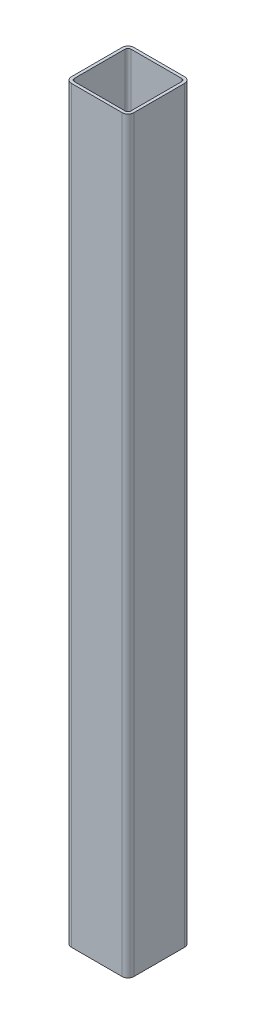
ISO-10303-21;
HEADER;
FILE_DESCRIPTION(('STEP AP214'),'2;1');
FILE_NAME('part.step','',(''),(''),'','','');
FILE_SCHEMA(('AUTOMOTIVE_DESIGN { 1 0 10303 214 1 1 1 1 }'));
ENDSEC;
DATA;
#1=APPLICATION_CONTEXT('core data for automotive mechanical design processes');
#2=APPLICATION_PROTOCOL_DEFINITION('international standard','automotive_design',2000,#1);
#3=PRODUCT_CONTEXT('',#1,'mechanical');
#4=PRODUCT('Part','Part','',(#3));
#5=PRODUCT_RELATED_PRODUCT_CATEGORY('part','',(#4));
#6=PRODUCT_DEFINITION_FORMATION('','',#4);
#7=PRODUCT_DEFINITION_CONTEXT('part definition',#1,'design');
#8=PRODUCT_DEFINITION('design','',#6,#7);
#9=PRODUCT_DEFINITION_SHAPE('','',#8);
#10=(LENGTH_UNIT() NAMED_UNIT(*) SI_UNIT(.MILLI.,.METRE.));
#11=(NAMED_UNIT(*) PLANE_ANGLE_UNIT() SI_UNIT($,.RADIAN.));
#12=(NAMED_UNIT(*) SI_UNIT($,.STERADIAN.) SOLID_ANGLE_UNIT());
#13=UNCERTAINTY_MEASURE_WITH_UNIT(LENGTH_MEASURE(1.E-05),#10,'distance_accuracy_value','');
#14=(GEOMETRIC_REPRESENTATION_CONTEXT(3) GLOBAL_UNCERTAINTY_ASSIGNED_CONTEXT((#13)) GLOBAL_UNIT_ASSIGNED_CONTEXT((#10,
#11,#12)) REPRESENTATION_CONTEXT('',''));
#15=CARTESIAN_POINT('',(0.,0.,0.));
#16=DIRECTION('',(0.,0.,1.));
#17=DIRECTION('',(1.,0.,0.));
#18=AXIS2_PLACEMENT_3D('',#15,#16,#17);
#19=CARTESIAN_POINT('',(41.275,609.6,-41.275));
#20=DIRECTION('',(0.,1.,0.));
#21=DIRECTION('',(0.,0.,1.));
#22=AXIS2_PLACEMENT_3D('',#19,#20,#21);
#23=PLANE('',#22);
#24=CARTESIAN_POINT('',(41.275,609.6,-41.275));
#25=DIRECTION('',(0.,1.,0.));
#26=DIRECTION('',(0.,0.,1.));
#27=AXIS2_PLACEMENT_3D('',#24,#25,#26);
#28=CIRCLE('',#27,9.525);
#29=CARTESIAN_POINT('',(50.8,609.6,-41.275));
#30=VERTEX_POINT('',#29);
#31=CARTESIAN_POINT('',(41.275,609.6,-50.8));
#32=VERTEX_POINT('',#31);
#33=EDGE_CURVE('E220',#30,#32,#28,.T.);
#34=ORIENTED_EDGE('',*,*,#33,.T.);
#35=DIRECTION('',(-1.,0.,0.));
#36=VECTOR('',#35,1.);
#37=CARTESIAN_POINT('',(41.275,609.6,-50.8));
#38=LINE('',#37,#36);
#39=CARTESIAN_POINT('',(-41.275,609.6,-50.7999999999999));
#40=VERTEX_POINT('',#39);
#41=EDGE_CURVE('E223',#32,#40,#38,.T.);
#42=ORIENTED_EDGE('',*,*,#41,.T.);
#43=CARTESIAN_POINT('',(-41.275,609.6,-41.2749999999999));
#44=DIRECTION('',(0.,1.,0.));
#45=DIRECTION('',(0.,0.,1.));
#46=AXIS2_PLACEMENT_3D('',#43,#44,#45);
#47=CIRCLE('',#46,9.52500000000001);
#48=CARTESIAN_POINT('',(-50.8,609.6,-41.2749999999999));
#49=VERTEX_POINT('',#48);
#50=EDGE_CURVE('E226',#40,#49,#47,.T.);
#51=ORIENTED_EDGE('',*,*,#50,.T.);
#52=DIRECTION('',(0.,0.,1.));
#53=VECTOR('',#52,1.);
#54=CARTESIAN_POINT('',(-50.8,609.6,41.275));
#55=LINE('',#54,#53);
#56=CARTESIAN_POINT('',(-50.8,609.6,41.275));
#57=VERTEX_POINT('',#56);
#58=EDGE_CURVE('E228',#49,#57,#55,.T.);
#59=ORIENTED_EDGE('',*,*,#58,.T.);
#60=CARTESIAN_POINT('',(-41.275,609.6,41.275));
#61=DIRECTION('',(0.,1.,0.));
#62=DIRECTION('',(0.,0.,1.));
#63=AXIS2_PLACEMENT_3D('',#60,#61,#62);
#64=CIRCLE('',#63,9.52499999999999);
#65=CARTESIAN_POINT('',(-41.275,609.6,50.8));
#66=VERTEX_POINT('',#65);
#67=EDGE_CURVE('E230',#57,#66,#64,.T.);
#68=ORIENTED_EDGE('',*,*,#67,.T.);
#69=DIRECTION('',(1.,0.,0.));
#70=VECTOR('',#69,1.);
#71=CARTESIAN_POINT('',(-41.275,609.6,50.8));
#72=LINE('',#71,#70);
#73=CARTESIAN_POINT('',(41.275,609.6,50.8));
#74=VERTEX_POINT('',#73);
#75=EDGE_CURVE('E232',#66,#74,#72,.T.);
#76=ORIENTED_EDGE('',*,*,#75,.T.);
#77=CARTESIAN_POINT('',(41.275,609.6,41.275));
#78=DIRECTION('',(0.,1.,0.));
#79=DIRECTION('',(0.,0.,1.));
#80=AXIS2_PLACEMENT_3D('',#77,#78,#79);
#81=CIRCLE('',#80,9.52500000000001);
#82=CARTESIAN_POINT('',(50.8,609.6,41.275));
#83=VERTEX_POINT('',#82);
#84=EDGE_CURVE('E234',#74,#83,#81,.T.);
#85=ORIENTED_EDGE('',*,*,#84,.T.);
#86=DIRECTION('',(0.,0.,-1.));
#87=VECTOR('',#86,1.);
#88=CARTESIAN_POINT('',(50.8,609.6,-41.275));
#89=LINE('',#88,#87);
#90=EDGE_CURVE('E236',#83,#30,#89,.T.);
#91=ORIENTED_EDGE('',*,*,#90,.T.);
#92=EDGE_LOOP('',(#34,#42,#51,#59,#68,#76,#85,#91));
#93=FACE_BOUND('',#92,.T.);
#94=DIRECTION('',(0.,0.,1.));
#95=VECTOR('',#94,1.);
#96=CARTESIAN_POINT('',(-46.0375,609.6,41.275));
#97=LINE('',#96,#95);
#98=CARTESIAN_POINT('',(-46.0375,609.6,-41.275));
#99=VERTEX_POINT('',#98);
#100=CARTESIAN_POINT('',(-46.0375,609.6,41.275));
#101=VERTEX_POINT('',#100);
#102=EDGE_CURVE('E157',#99,#101,#97,.T.);
#103=ORIENTED_EDGE('',*,*,#102,.F.);
#104=CARTESIAN_POINT('',(-41.275,609.6,-41.275));
#105=DIRECTION('',(0.,1.,0.));
#106=DIRECTION('',(0.,0.,1.));
#107=AXIS2_PLACEMENT_3D('',#104,#105,#106);
#108=CIRCLE('',#107,4.76249999999998);
#109=CARTESIAN_POINT('',(-41.275,609.6,-46.0375));
#110=VERTEX_POINT('',#109);
#111=EDGE_CURVE('E149',#110,#99,#108,.T.);
#112=ORIENTED_EDGE('',*,*,#111,.F.);
#113=DIRECTION('',(-1.,0.,0.));
#114=VECTOR('',#113,1.);
#115=CARTESIAN_POINT('',(41.275,609.6,-46.0375));
#116=LINE('',#115,#114);
#117=CARTESIAN_POINT('',(41.275,609.6,-46.0375));
#118=VERTEX_POINT('',#117);
#119=EDGE_CURVE('E183',#118,#110,#116,.T.);
#120=ORIENTED_EDGE('',*,*,#119,.F.);
#121=CARTESIAN_POINT('',(41.275,609.6,-41.275));
#122=DIRECTION('',(0.,1.,0.));
#123=DIRECTION('',(0.,0.,1.));
#124=AXIS2_PLACEMENT_3D('',#121,#122,#123);
#125=CIRCLE('',#124,4.76249999999998);
#126=CARTESIAN_POINT('',(46.0375,609.6,-41.275));
#127=VERTEX_POINT('',#126);
#128=EDGE_CURVE('E181',#127,#118,#125,.T.);
#129=ORIENTED_EDGE('',*,*,#128,.F.);
#130=DIRECTION('',(0.,0.,-1.));
#131=VECTOR('',#130,1.);
#132=CARTESIAN_POINT('',(46.0375,609.6,-41.275));
#133=LINE('',#132,#131);
#134=CARTESIAN_POINT('',(46.0375,609.6,41.275));
#135=VERTEX_POINT('',#134);
#136=EDGE_CURVE('E179',#135,#127,#133,.T.);
#137=ORIENTED_EDGE('',*,*,#136,.F.);
#138=CARTESIAN_POINT('',(41.275,609.6,41.275));
#139=DIRECTION('',(0.,1.,0.));
#140=DIRECTION('',(0.,0.,1.));
#141=AXIS2_PLACEMENT_3D('',#138,#139,#140);
#142=CIRCLE('',#141,4.76249999999998);
#143=CARTESIAN_POINT('',(41.275,609.6,46.0375));
#144=VERTEX_POINT('',#143);
#145=EDGE_CURVE('E177',#144,#135,#142,.T.);
#146=ORIENTED_EDGE('',*,*,#145,.F.);
#147=DIRECTION('',(1.,0.,0.));
#148=VECTOR('',#147,1.);
#149=CARTESIAN_POINT('',(-41.275,609.6,46.0375));
#150=LINE('',#149,#148);
#151=CARTESIAN_POINT('',(-41.275,609.6,46.0375));
#152=VERTEX_POINT('',#151);
#153=EDGE_CURVE('E173',#152,#144,#150,.T.);
#154=ORIENTED_EDGE('',*,*,#153,.F.);
#155=CARTESIAN_POINT('',(-41.275,609.6,41.275));
#156=DIRECTION('',(0.,1.,0.));
#157=DIRECTION('',(0.,0.,1.));
#158=AXIS2_PLACEMENT_3D('',#155,#156,#157);
#159=CIRCLE('',#158,4.76249999999998);
#160=EDGE_CURVE('E171',#101,#152,#159,.T.);
#161=ORIENTED_EDGE('',*,*,#160,.F.);
#162=EDGE_LOOP('',(#103,#112,#120,#129,#137,#146,#154,#161));
#163=FACE_BOUND('',#162,.T.);
#164=ADVANCED_FACE('F35',(#93,#163),#23,.T.);
#165=CARTESIAN_POINT('',(41.275,-609.6,-41.275));
#166=DIRECTION('',(0.,1.,0.));
#167=DIRECTION('',(0.,0.,1.));
#168=AXIS2_PLACEMENT_3D('',#165,#166,#167);
#169=PLANE('',#168);
#170=CARTESIAN_POINT('',(41.275,-609.6,-41.275));
#171=DIRECTION('',(0.,1.,0.));
#172=DIRECTION('',(0.,0.,1.));
#173=AXIS2_PLACEMENT_3D('',#170,#171,#172);
#174=CIRCLE('',#173,9.525);
#175=CARTESIAN_POINT('',(50.8,-609.6,-41.275));
#176=VERTEX_POINT('',#175);
#177=CARTESIAN_POINT('',(41.275,-609.6,-50.8));
#178=VERTEX_POINT('',#177);
#179=EDGE_CURVE('E166',#176,#178,#174,.T.);
#180=ORIENTED_EDGE('',*,*,#179,.F.);
#181=DIRECTION('',(0.,0.,-1.));
#182=VECTOR('',#181,1.);
#183=CARTESIAN_POINT('',(50.8,-609.6,-41.275));
#184=LINE('',#183,#182);
#185=CARTESIAN_POINT('',(50.8,-609.6,41.275));
#186=VERTEX_POINT('',#185);
#187=EDGE_CURVE('E224',#186,#176,#184,.T.);
#188=ORIENTED_EDGE('',*,*,#187,.F.);
#189=CARTESIAN_POINT('',(41.275,-609.6,41.275));
#190=DIRECTION('',(0.,1.,0.));
#191=DIRECTION('',(0.,0.,1.));
#192=AXIS2_PLACEMENT_3D('',#189,#190,#191);
#193=CIRCLE('',#192,9.52500000000001);
#194=CARTESIAN_POINT('',(41.275,-609.6,50.8));
#195=VERTEX_POINT('',#194);
#196=EDGE_CURVE('E252',#195,#186,#193,.T.);
#197=ORIENTED_EDGE('',*,*,#196,.F.);
#198=DIRECTION('',(1.,0.,0.));
#199=VECTOR('',#198,1.);
#200=CARTESIAN_POINT('',(-41.275,-609.6,50.8));
#201=LINE('',#200,#199);
#202=CARTESIAN_POINT('',(-41.275,-609.6,50.8));
#203=VERTEX_POINT('',#202);
#204=EDGE_CURVE('E250',#203,#195,#201,.T.);
#205=ORIENTED_EDGE('',*,*,#204,.F.);
#206=CARTESIAN_POINT('',(-41.275,-609.6,41.275));
#207=DIRECTION('',(0.,1.,0.));
#208=DIRECTION('',(0.,0.,1.));
#209=AXIS2_PLACEMENT_3D('',#206,#207,#208);
#210=CIRCLE('',#209,9.52499999999999);
#211=CARTESIAN_POINT('',(-50.8,-609.6,41.275));
#212=VERTEX_POINT('',#211);
#213=EDGE_CURVE('E248',#212,#203,#210,.T.);
#214=ORIENTED_EDGE('',*,*,#213,.F.);
#215=DIRECTION('',(0.,0.,1.));
#216=VECTOR('',#215,1.);
#217=CARTESIAN_POINT('',(-50.8,-609.6,41.275));
#218=LINE('',#217,#216);
#219=CARTESIAN_POINT('',(-50.8,-609.6,-41.2749999999999));
#220=VERTEX_POINT('',#219);
#221=EDGE_CURVE('E246',#220,#212,#218,.T.);
#222=ORIENTED_EDGE('',*,*,#221,.F.);
#223=CARTESIAN_POINT('',(-41.275,-609.6,-41.2749999999999));
#224=DIRECTION('',(0.,1.,0.));
#225=DIRECTION('',(0.,0.,1.));
#226=AXIS2_PLACEMENT_3D('',#223,#224,#225);
#227=CIRCLE('',#226,9.52500000000001);
#228=CARTESIAN_POINT('',(-41.275,-609.6,-50.7999999999999));
#229=VERTEX_POINT('',#228);
#230=EDGE_CURVE('E244',#229,#220,#227,.T.);
#231=ORIENTED_EDGE('',*,*,#230,.F.);
#232=DIRECTION('',(-1.,0.,0.));
#233=VECTOR('',#232,1.);
#234=CARTESIAN_POINT('',(41.275,-609.6,-50.8));
#235=LINE('',#234,#233);
#236=EDGE_CURVE('E242',#178,#229,#235,.T.);
#237=ORIENTED_EDGE('',*,*,#236,.F.);
#238=EDGE_LOOP('',(#180,#188,#197,#205,#214,#222,#231,#237));
#239=FACE_BOUND('',#238,.T.);
#240=CARTESIAN_POINT('',(-41.275,-609.6,-41.275));
#241=DIRECTION('',(0.,1.,0.));
#242=DIRECTION('',(0.,0.,1.));
#243=AXIS2_PLACEMENT_3D('',#240,#241,#242);
#244=CIRCLE('',#243,4.76249999999998);
#245=CARTESIAN_POINT('',(-41.275,-609.6,-46.0375));
#246=VERTEX_POINT('',#245);
#247=CARTESIAN_POINT('',(-46.0375,-609.6,-41.275));
#248=VERTEX_POINT('',#247);
#249=EDGE_CURVE('E59',#246,#248,#244,.T.);
#250=ORIENTED_EDGE('',*,*,#249,.T.);
#251=DIRECTION('',(0.,0.,1.));
#252=VECTOR('',#251,1.);
#253=CARTESIAN_POINT('',(-46.0375,-609.6,41.275));
#254=LINE('',#253,#252);
#255=CARTESIAN_POINT('',(-46.0375,-609.6,41.275));
#256=VERTEX_POINT('',#255);
#257=EDGE_CURVE('E164',#248,#256,#254,.T.);
#258=ORIENTED_EDGE('',*,*,#257,.T.);
#259=CARTESIAN_POINT('',(-41.275,-609.6,41.275));
#260=DIRECTION('',(0.,1.,0.));
#261=DIRECTION('',(0.,0.,1.));
#262=AXIS2_PLACEMENT_3D('',#259,#260,#261);
#263=CIRCLE('',#262,4.76249999999998);
#264=CARTESIAN_POINT('',(-41.275,-609.6,46.0375));
#265=VERTEX_POINT('',#264);
#266=EDGE_CURVE('E187',#256,#265,#263,.T.);
#267=ORIENTED_EDGE('',*,*,#266,.T.);
#268=DIRECTION('',(1.,0.,0.));
#269=VECTOR('',#268,1.);
#270=CARTESIAN_POINT('',(-41.275,-609.6,46.0375));
#271=LINE('',#270,#269);
#272=CARTESIAN_POINT('',(41.275,-609.6,46.0375));
#273=VERTEX_POINT('',#272);
#274=EDGE_CURVE('E190',#265,#273,#271,.T.);
#275=ORIENTED_EDGE('',*,*,#274,.T.);
#276=CARTESIAN_POINT('',(41.275,-609.6,41.275));
#277=DIRECTION('',(0.,1.,0.));
#278=DIRECTION('',(0.,0.,1.));
#279=AXIS2_PLACEMENT_3D('',#276,#277,#278);
#280=CIRCLE('',#279,4.76249999999998);
#281=CARTESIAN_POINT('',(46.0375,-609.6,41.275));
#282=VERTEX_POINT('',#281);
#283=EDGE_CURVE('E193',#273,#282,#280,.T.);
#284=ORIENTED_EDGE('',*,*,#283,.T.);
#285=DIRECTION('',(0.,0.,-1.));
#286=VECTOR('',#285,1.);
#287=CARTESIAN_POINT('',(46.0375,-609.6,-41.275));
#288=LINE('',#287,#286);
#289=CARTESIAN_POINT('',(46.0375,-609.6,-41.275));
#290=VERTEX_POINT('',#289);
#291=EDGE_CURVE('E196',#282,#290,#288,.T.);
#292=ORIENTED_EDGE('',*,*,#291,.T.);
#293=CARTESIAN_POINT('',(41.275,-609.6,-41.275));
#294=DIRECTION('',(0.,1.,0.));
#295=DIRECTION('',(0.,0.,1.));
#296=AXIS2_PLACEMENT_3D('',#293,#294,#295);
#297=CIRCLE('',#296,4.76249999999998);
#298=CARTESIAN_POINT('',(41.275,-609.6,-46.0375));
#299=VERTEX_POINT('',#298);
#300=EDGE_CURVE('E199',#290,#299,#297,.T.);
#301=ORIENTED_EDGE('',*,*,#300,.T.);
#302=DIRECTION('',(-1.,0.,0.));
#303=VECTOR('',#302,1.);
#304=CARTESIAN_POINT('',(41.275,-609.6,-46.0375));
#305=LINE('',#304,#303);
#306=EDGE_CURVE('E158',#299,#246,#305,.T.);
#307=ORIENTED_EDGE('',*,*,#306,.T.);
#308=EDGE_LOOP('',(#250,#258,#267,#275,#284,#292,#301,#307));
#309=FACE_BOUND('',#308,.T.);
#310=ADVANCED_FACE('F286',(#239,#309),#169,.F.);
#311=CARTESIAN_POINT('',(41.275,609.6,-41.275));
#312=DIRECTION('',(0.,-1.,0.));
#313=DIRECTION('',(0.,0.,-1.));
#314=AXIS2_PLACEMENT_3D('',#311,#312,#313);
#315=CYLINDRICAL_SURFACE('',#314,9.525);
#316=ORIENTED_EDGE('',*,*,#179,.T.);
#317=DIRECTION('',(0.,-1.,0.));
#318=VECTOR('',#317,1.);
#319=CARTESIAN_POINT('',(41.275,609.6,-50.8));
#320=LINE('',#319,#318);
#321=EDGE_CURVE('E11',#32,#178,#320,.T.);
#322=ORIENTED_EDGE('',*,*,#321,.F.);
#323=ORIENTED_EDGE('',*,*,#33,.F.);
#324=DIRECTION('',(0.,-1.,0.));
#325=VECTOR('',#324,1.);
#326=CARTESIAN_POINT('',(50.8,609.6,-41.275));
#327=LINE('',#326,#325);
#328=EDGE_CURVE('E239',#30,#176,#327,.T.);
#329=ORIENTED_EDGE('',*,*,#328,.T.);
#330=EDGE_LOOP('',(#316,#322,#323,#329));
#331=FACE_BOUND('',#330,.T.);
#332=ADVANCED_FACE('F37',(#331),#315,.T.);
#333=CARTESIAN_POINT('',(41.275,609.6,-50.8));
#334=DIRECTION('',(0.,0.,1.));
#335=DIRECTION('',(1.,0.,0.));
#336=AXIS2_PLACEMENT_3D('',#333,#334,#335);
#337=PLANE('',#336);
#338=ORIENTED_EDGE('',*,*,#236,.T.);
#339=DIRECTION('',(0.,-1.,0.));
#340=VECTOR('',#339,1.);
#341=CARTESIAN_POINT('',(-41.275,609.6,-50.7999999999999));
#342=LINE('',#341,#340);
#343=EDGE_CURVE('E44',#40,#229,#342,.T.);
#344=ORIENTED_EDGE('',*,*,#343,.F.);
#345=ORIENTED_EDGE('',*,*,#41,.F.);
#346=ORIENTED_EDGE('',*,*,#321,.T.);
#347=EDGE_LOOP('',(#338,#344,#345,#346));
#348=FACE_BOUND('',#347,.T.);
#349=ADVANCED_FACE('F303',(#348),#337,.F.);
#350=CARTESIAN_POINT('',(-41.275,609.6,-41.2749999999999));
#351=DIRECTION('',(0.,-1.,0.));
#352=DIRECTION('',(0.,0.,-1.));
#353=AXIS2_PLACEMENT_3D('',#350,#351,#352);
#354=CYLINDRICAL_SURFACE('',#353,9.52500000000001);
#355=ORIENTED_EDGE('',*,*,#230,.T.);
#356=DIRECTION('',(0.,-1.,0.));
#357=VECTOR('',#356,1.);
#358=CARTESIAN_POINT('',(-50.8,609.6,-41.2749999999999));
#359=LINE('',#358,#357);
#360=EDGE_CURVE('E272',#49,#220,#359,.T.);
#361=ORIENTED_EDGE('',*,*,#360,.F.);
#362=ORIENTED_EDGE('',*,*,#50,.F.);
#363=ORIENTED_EDGE('',*,*,#343,.T.);
#364=EDGE_LOOP('',(#355,#361,#362,#363));
#365=FACE_BOUND('',#364,.T.);
#366=ADVANCED_FACE('F280',(#365),#354,.T.);
#367=CARTESIAN_POINT('',(-50.8,609.6,41.275));
#368=DIRECTION('',(1.,0.,0.));
#369=DIRECTION('',(0.,0.,-1.));
#370=AXIS2_PLACEMENT_3D('',#367,#368,#369);
#371=PLANE('',#370);
#372=ORIENTED_EDGE('',*,*,#221,.T.);
#373=DIRECTION('',(0.,-1.,0.));
#374=VECTOR('',#373,1.);
#375=CARTESIAN_POINT('',(-50.8,609.6,41.275));
#376=LINE('',#375,#374);
#377=EDGE_CURVE('E269',#57,#212,#376,.T.);
#378=ORIENTED_EDGE('',*,*,#377,.F.);
#379=ORIENTED_EDGE('',*,*,#58,.F.);
#380=ORIENTED_EDGE('',*,*,#360,.T.);
#381=EDGE_LOOP('',(#372,#378,#379,#380));
#382=FACE_BOUND('',#381,.T.);
#383=ADVANCED_FACE('F292',(#382),#371,.F.);
#384=CARTESIAN_POINT('',(-41.275,609.6,41.275));
#385=DIRECTION('',(0.,-1.,0.));
#386=DIRECTION('',(0.,0.,-1.));
#387=AXIS2_PLACEMENT_3D('',#384,#385,#386);
#388=CYLINDRICAL_SURFACE('',#387,9.52499999999999);
#389=ORIENTED_EDGE('',*,*,#213,.T.);
#390=DIRECTION('',(0.,-1.,0.));
#391=VECTOR('',#390,1.);
#392=CARTESIAN_POINT('',(-41.275,609.6,50.8));
#393=LINE('',#392,#391);
#394=EDGE_CURVE('E266',#66,#203,#393,.T.);
#395=ORIENTED_EDGE('',*,*,#394,.F.);
#396=ORIENTED_EDGE('',*,*,#67,.F.);
#397=ORIENTED_EDGE('',*,*,#377,.T.);
#398=EDGE_LOOP('',(#389,#395,#396,#397));
#399=FACE_BOUND('',#398,.T.);
#400=ADVANCED_FACE('F296',(#399),#388,.T.);
#401=CARTESIAN_POINT('',(-41.275,609.6,50.8));
#402=DIRECTION('',(0.,0.,-1.));
#403=DIRECTION('',(-1.,0.,0.));
#404=AXIS2_PLACEMENT_3D('',#401,#402,#403);
#405=PLANE('',#404);
#406=ORIENTED_EDGE('',*,*,#204,.T.);
#407=DIRECTION('',(0.,-1.,0.));
#408=VECTOR('',#407,1.);
#409=CARTESIAN_POINT('',(41.275,609.6,50.8));
#410=LINE('',#409,#408);
#411=EDGE_CURVE('E262',#74,#195,#410,.T.);
#412=ORIENTED_EDGE('',*,*,#411,.F.);
#413=ORIENTED_EDGE('',*,*,#75,.F.);
#414=ORIENTED_EDGE('',*,*,#394,.T.);
#415=EDGE_LOOP('',(#406,#412,#413,#414));
#416=FACE_BOUND('',#415,.T.);
#417=ADVANCED_FACE('F316',(#416),#405,.F.);
#418=CARTESIAN_POINT('',(41.275,609.6,41.275));
#419=DIRECTION('',(0.,-1.,0.));
#420=DIRECTION('',(0.,0.,-1.));
#421=AXIS2_PLACEMENT_3D('',#418,#419,#420);
#422=CYLINDRICAL_SURFACE('',#421,9.52500000000001);
#423=ORIENTED_EDGE('',*,*,#196,.T.);
#424=DIRECTION('',(0.,-1.,0.));
#425=VECTOR('',#424,1.);
#426=CARTESIAN_POINT('',(50.8,609.6,41.275));
#427=LINE('',#426,#425);
#428=EDGE_CURVE('E258',#83,#186,#427,.T.);
#429=ORIENTED_EDGE('',*,*,#428,.F.);
#430=ORIENTED_EDGE('',*,*,#84,.F.);
#431=ORIENTED_EDGE('',*,*,#411,.T.);
#432=EDGE_LOOP('',(#423,#429,#430,#431));
#433=FACE_BOUND('',#432,.T.);
#434=ADVANCED_FACE('F314',(#433),#422,.T.);
#435=CARTESIAN_POINT('',(50.8,609.6,-41.275));
#436=DIRECTION('',(-1.,0.,0.));
#437=DIRECTION('',(0.,0.,1.));
#438=AXIS2_PLACEMENT_3D('',#435,#436,#437);
#439=PLANE('',#438);
#440=ORIENTED_EDGE('',*,*,#187,.T.);
#441=ORIENTED_EDGE('',*,*,#328,.F.);
#442=ORIENTED_EDGE('',*,*,#90,.F.);
#443=ORIENTED_EDGE('',*,*,#428,.T.);
#444=EDGE_LOOP('',(#440,#441,#442,#443));
#445=FACE_BOUND('',#444,.T.);
#446=ADVANCED_FACE('F309',(#445),#439,.F.);
#447=CARTESIAN_POINT('',(-41.275,609.6,-41.275));
#448=DIRECTION('',(0.,-1.,0.));
#449=DIRECTION('',(0.,0.,-1.));
#450=AXIS2_PLACEMENT_3D('',#447,#448,#449);
#451=CYLINDRICAL_SURFACE('',#450,4.76249999999998);
#452=ORIENTED_EDGE('',*,*,#249,.F.);
#453=DIRECTION('',(0.,-1.,0.));
#454=VECTOR('',#453,1.);
#455=CARTESIAN_POINT('',(-41.275,609.6,-46.0375));
#456=LINE('',#455,#454);
#457=EDGE_CURVE('E153',#110,#246,#456,.T.);
#458=ORIENTED_EDGE('',*,*,#457,.F.);
#459=ORIENTED_EDGE('',*,*,#111,.T.);
#460=DIRECTION('',(0.,-1.,0.));
#461=VECTOR('',#460,1.);
#462=CARTESIAN_POINT('',(-46.0375,609.6,-41.275));
#463=LINE('',#462,#461);
#464=EDGE_CURVE('E152',#99,#248,#463,.T.);
#465=ORIENTED_EDGE('',*,*,#464,.T.);
#466=EDGE_LOOP('',(#452,#458,#459,#465));
#467=FACE_BOUND('',#466,.T.);
#468=ADVANCED_FACE('F151',(#467),#451,.F.);
#469=CARTESIAN_POINT('',(-46.0375,609.6,41.275));
#470=DIRECTION('',(1.,0.,0.));
#471=DIRECTION('',(0.,0.,-1.));
#472=AXIS2_PLACEMENT_3D('',#469,#470,#471);
#473=PLANE('',#472);
#474=ORIENTED_EDGE('',*,*,#257,.F.);
#475=ORIENTED_EDGE('',*,*,#464,.F.);
#476=ORIENTED_EDGE('',*,*,#102,.T.);
#477=DIRECTION('',(0.,-1.,0.));
#478=VECTOR('',#477,1.);
#479=CARTESIAN_POINT('',(-46.0375,609.6,41.275));
#480=LINE('',#479,#478);
#481=EDGE_CURVE('E167',#101,#256,#480,.T.);
#482=ORIENTED_EDGE('',*,*,#481,.T.);
#483=EDGE_LOOP('',(#474,#475,#476,#482));
#484=FACE_BOUND('',#483,.T.);
#485=ADVANCED_FACE('F161',(#484),#473,.T.);
#486=CARTESIAN_POINT('',(-41.275,609.6,41.275));
#487=DIRECTION('',(0.,-1.,0.));
#488=DIRECTION('',(0.,0.,-1.));
#489=AXIS2_PLACEMENT_3D('',#486,#487,#488);
#490=CYLINDRICAL_SURFACE('',#489,4.76249999999998);
#491=ORIENTED_EDGE('',*,*,#266,.F.);
#492=ORIENTED_EDGE('',*,*,#481,.F.);
#493=ORIENTED_EDGE('',*,*,#160,.T.);
#494=DIRECTION('',(0.,-1.,0.));
#495=VECTOR('',#494,1.);
#496=CARTESIAN_POINT('',(-41.275,609.6,46.0375));
#497=LINE('',#496,#495);
#498=EDGE_CURVE('E217',#152,#265,#497,.T.);
#499=ORIENTED_EDGE('',*,*,#498,.T.);
#500=EDGE_LOOP('',(#491,#492,#493,#499));
#501=FACE_BOUND('',#500,.T.);
#502=ADVANCED_FACE('F341',(#501),#490,.F.);
#503=CARTESIAN_POINT('',(-41.275,609.6,46.0375));
#504=DIRECTION('',(0.,0.,-1.));
#505=DIRECTION('',(-1.,0.,0.));
#506=AXIS2_PLACEMENT_3D('',#503,#504,#505);
#507=PLANE('',#506);
#508=ORIENTED_EDGE('',*,*,#274,.F.);
#509=ORIENTED_EDGE('',*,*,#498,.F.);
#510=ORIENTED_EDGE('',*,*,#153,.T.);
#511=DIRECTION('',(0.,-1.,0.));
#512=VECTOR('',#511,1.);
#513=CARTESIAN_POINT('',(41.275,609.6,46.0375));
#514=LINE('',#513,#512);
#515=EDGE_CURVE('E214',#144,#273,#514,.T.);
#516=ORIENTED_EDGE('',*,*,#515,.T.);
#517=EDGE_LOOP('',(#508,#509,#510,#516));
#518=FACE_BOUND('',#517,.T.);
#519=ADVANCED_FACE('F345',(#518),#507,.T.);
#520=CARTESIAN_POINT('',(41.275,609.6,41.275));
#521=DIRECTION('',(0.,-1.,0.));
#522=DIRECTION('',(0.,0.,-1.));
#523=AXIS2_PLACEMENT_3D('',#520,#521,#522);
#524=CYLINDRICAL_SURFACE('',#523,4.76249999999998);
#525=ORIENTED_EDGE('',*,*,#283,.F.);
#526=ORIENTED_EDGE('',*,*,#515,.F.);
#527=ORIENTED_EDGE('',*,*,#145,.T.);
#528=DIRECTION('',(0.,-1.,0.));
#529=VECTOR('',#528,1.);
#530=CARTESIAN_POINT('',(46.0375,609.6,41.275));
#531=LINE('',#530,#529);
#532=EDGE_CURVE('E211',#135,#282,#531,.T.);
#533=ORIENTED_EDGE('',*,*,#532,.T.);
#534=EDGE_LOOP('',(#525,#526,#527,#533));
#535=FACE_BOUND('',#534,.T.);
#536=ADVANCED_FACE('F351',(#535),#524,.F.);
#537=CARTESIAN_POINT('',(46.0375,609.6,-41.275));
#538=DIRECTION('',(-1.,0.,0.));
#539=DIRECTION('',(0.,0.,1.));
#540=AXIS2_PLACEMENT_3D('',#537,#538,#539);
#541=PLANE('',#540);
#542=ORIENTED_EDGE('',*,*,#291,.F.);
#543=ORIENTED_EDGE('',*,*,#532,.F.);
#544=ORIENTED_EDGE('',*,*,#136,.T.);
#545=DIRECTION('',(0.,-1.,0.));
#546=VECTOR('',#545,1.);
#547=CARTESIAN_POINT('',(46.0375,609.6,-41.275));
#548=LINE('',#547,#546);
#549=EDGE_CURVE('E208',#127,#290,#548,.T.);
#550=ORIENTED_EDGE('',*,*,#549,.T.);
#551=EDGE_LOOP('',(#542,#543,#544,#550));
#552=FACE_BOUND('',#551,.T.);
#553=ADVANCED_FACE('F355',(#552),#541,.T.);
#554=CARTESIAN_POINT('',(41.275,609.6,-41.275));
#555=DIRECTION('',(0.,-1.,0.));
#556=DIRECTION('',(0.,0.,-1.));
#557=AXIS2_PLACEMENT_3D('',#554,#555,#556);
#558=CYLINDRICAL_SURFACE('',#557,4.76249999999998);
#559=ORIENTED_EDGE('',*,*,#300,.F.);
#560=ORIENTED_EDGE('',*,*,#549,.F.);
#561=ORIENTED_EDGE('',*,*,#128,.T.);
#562=DIRECTION('',(0.,-1.,0.));
#563=VECTOR('',#562,1.);
#564=CARTESIAN_POINT('',(41.275,609.6,-46.0375));
#565=LINE('',#564,#563);
#566=EDGE_CURVE('E51',#118,#299,#565,.T.);
#567=ORIENTED_EDGE('',*,*,#566,.T.);
#568=EDGE_LOOP('',(#559,#560,#561,#567));
#569=FACE_BOUND('',#568,.T.);
#570=ADVANCED_FACE('F359',(#569),#558,.F.);
#571=CARTESIAN_POINT('',(41.275,609.6,-46.0375));
#572=DIRECTION('',(0.,0.,1.));
#573=DIRECTION('',(1.,0.,0.));
#574=AXIS2_PLACEMENT_3D('',#571,#572,#573);
#575=PLANE('',#574);
#576=ORIENTED_EDGE('',*,*,#306,.F.);
#577=ORIENTED_EDGE('',*,*,#566,.F.);
#578=ORIENTED_EDGE('',*,*,#119,.T.);
#579=ORIENTED_EDGE('',*,*,#457,.T.);
#580=EDGE_LOOP('',(#576,#577,#578,#579));
#581=FACE_BOUND('',#580,.T.);
#582=ADVANCED_FACE('F363',(#581),#575,.T.);
#583=CLOSED_SHELL('',(#164,#310,#332,#349,#366,#383,#400,#417,#434,#446,#468,#485,#502,#519,
#536,#553,#570,#582));
#584=MANIFOLD_SOLID_BREP('B2',#583);
#585=ADVANCED_BREP_SHAPE_REPRESENTATION('',(#18,#584),#14);
#586=SHAPE_DEFINITION_REPRESENTATION(#9,#585);
ENDSEC;
END-ISO-10303-21;
